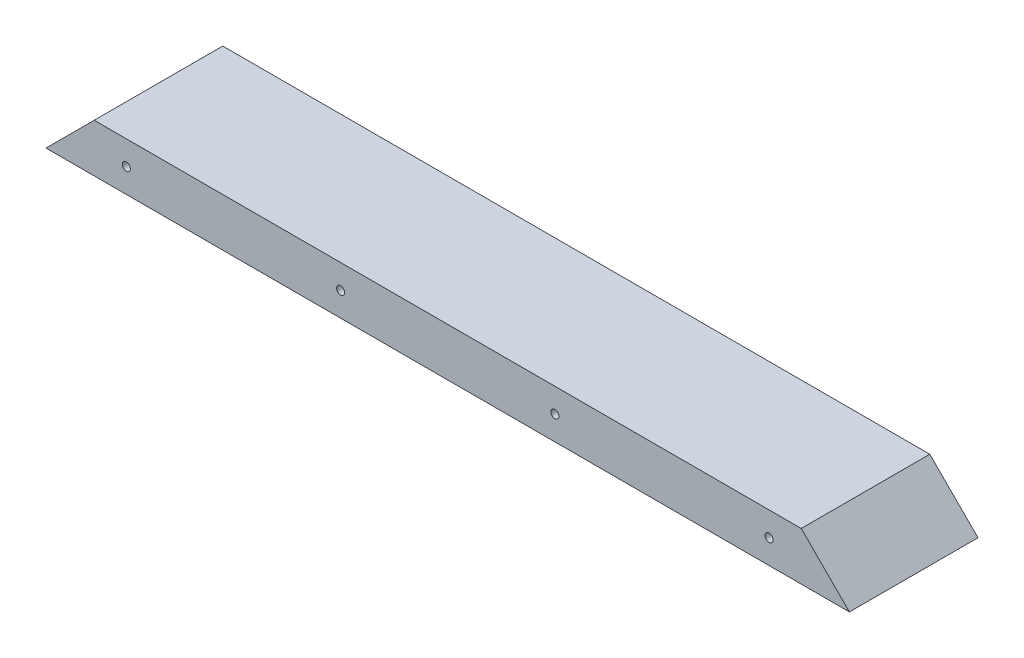
ISO-10303-21;
HEADER;
FILE_DESCRIPTION(('STEP AP214'),'2;1');
FILE_NAME('part.step','',(''),(''),'','','');
FILE_SCHEMA(('AUTOMOTIVE_DESIGN { 1 0 10303 214 1 1 1 1 }'));
ENDSEC;
DATA;
#1=APPLICATION_CONTEXT('core data for automotive mechanical design processes');
#2=APPLICATION_PROTOCOL_DEFINITION('international standard','automotive_design',2000,#1);
#3=PRODUCT_CONTEXT('',#1,'mechanical');
#4=PRODUCT('Part','Part','',(#3));
#5=PRODUCT_RELATED_PRODUCT_CATEGORY('part','',(#4));
#6=PRODUCT_DEFINITION_FORMATION('','',#4);
#7=PRODUCT_DEFINITION_CONTEXT('part definition',#1,'design');
#8=PRODUCT_DEFINITION('design','',#6,#7);
#9=PRODUCT_DEFINITION_SHAPE('','',#8);
#10=(LENGTH_UNIT() NAMED_UNIT(*) SI_UNIT(.MILLI.,.METRE.));
#11=(NAMED_UNIT(*) PLANE_ANGLE_UNIT() SI_UNIT($,.RADIAN.));
#12=(NAMED_UNIT(*) SI_UNIT($,.STERADIAN.) SOLID_ANGLE_UNIT());
#13=UNCERTAINTY_MEASURE_WITH_UNIT(LENGTH_MEASURE(1.E-05),#10,'distance_accuracy_value','');
#14=(GEOMETRIC_REPRESENTATION_CONTEXT(3) GLOBAL_UNCERTAINTY_ASSIGNED_CONTEXT((#13)) GLOBAL_UNIT_ASSIGNED_CONTEXT((#10,
#11,#12)) REPRESENTATION_CONTEXT('',''));
#15=CARTESIAN_POINT('',(0.,0.,0.));
#16=DIRECTION('',(0.,0.,1.));
#17=DIRECTION('',(1.,0.,0.));
#18=AXIS2_PLACEMENT_3D('',#15,#16,#17);
#19=CARTESIAN_POINT('',(250.,15.,20.));
#20=DIRECTION('',(0.,0.,-1.));
#21=DIRECTION('',(0.,1.,0.));
#22=AXIS2_PLACEMENT_3D('',#19,#20,#21);
#23=PLANE('',#22);
#24=CARTESIAN_POINT('',(91.6666666666667,7.50000000000017,20.));
#25=DIRECTION('',(0.,0.,-1.));
#26=DIRECTION('',(0.,1.,0.));
#27=AXIS2_PLACEMENT_3D('',#24,#25,#26);
#28=CIRCLE('',#27,1.25000000000001);
#29=CARTESIAN_POINT('',(91.6666666666667,8.75000000000018,20.));
#30=VERTEX_POINT('',#29);
#31=EDGE_CURVE('E113',#30,#30,#28,.T.);
#32=ORIENTED_EDGE('',*,*,#31,.T.);
#33=EDGE_LOOP('',(#32));
#34=FACE_BOUND('',#33,.T.);
#35=CARTESIAN_POINT('',(158.333333333333,7.49999999999995,20.));
#36=DIRECTION('',(0.,0.,-1.));
#37=DIRECTION('',(0.,1.,0.));
#38=AXIS2_PLACEMENT_3D('',#35,#36,#37);
#39=CIRCLE('',#38,1.25000000000001);
#40=CARTESIAN_POINT('',(158.333333333333,8.74999999999996,20.));
#41=VERTEX_POINT('',#40);
#42=EDGE_CURVE('E107',#41,#41,#39,.T.);
#43=ORIENTED_EDGE('',*,*,#42,.T.);
#44=EDGE_LOOP('',(#43));
#45=FACE_BOUND('',#44,.T.);
#46=CARTESIAN_POINT('',(225.,7.49999999999972,20.));
#47=DIRECTION('',(0.,0.,-1.));
#48=DIRECTION('',(0.,1.,0.));
#49=AXIS2_PLACEMENT_3D('',#46,#47,#48);
#50=CIRCLE('',#49,1.24999999999996);
#51=CARTESIAN_POINT('',(225.,8.74999999999968,20.));
#52=VERTEX_POINT('',#51);
#53=EDGE_CURVE('E101',#52,#52,#50,.T.);
#54=ORIENTED_EDGE('',*,*,#53,.T.);
#55=EDGE_LOOP('',(#54));
#56=FACE_BOUND('',#55,.T.);
#57=CARTESIAN_POINT('',(25.,7.50000000000042,20.));
#58=DIRECTION('',(0.,0.,-1.));
#59=DIRECTION('',(0.,-1.,0.));
#60=AXIS2_PLACEMENT_3D('',#57,#58,#59);
#61=CIRCLE('',#60,1.24999999999996);
#62=CARTESIAN_POINT('',(25.,6.25000000000046,20.));
#63=VERTEX_POINT('',#62);
#64=EDGE_CURVE('E95',#63,#63,#61,.T.);
#65=ORIENTED_EDGE('',*,*,#64,.T.);
#66=EDGE_LOOP('',(#65));
#67=FACE_BOUND('',#66,.T.);
#68=DIRECTION('',(-1.,0.,0.));
#69=VECTOR('',#68,1.);
#70=CARTESIAN_POINT('',(250.,0.,20.));
#71=LINE('',#70,#69);
#72=CARTESIAN_POINT('',(250.,0.,20.));
#73=VERTEX_POINT('',#72);
#74=CARTESIAN_POINT('',(0.,0.,20.));
#75=VERTEX_POINT('',#74);
#76=EDGE_CURVE('E41',#73,#75,#71,.T.);
#77=ORIENTED_EDGE('',*,*,#76,.F.);
#78=DIRECTION('',(-0.707106781186548,0.707106781186547,0.));
#79=VECTOR('',#78,1.);
#80=CARTESIAN_POINT('',(235.,15.,20.));
#81=LINE('',#80,#79);
#82=CARTESIAN_POINT('',(235.,15.,20.));
#83=VERTEX_POINT('',#82);
#84=EDGE_CURVE('E47',#73,#83,#81,.T.);
#85=ORIENTED_EDGE('',*,*,#84,.T.);
#86=DIRECTION('',(-1.,0.,0.));
#87=VECTOR('',#86,1.);
#88=CARTESIAN_POINT('',(250.,15.,20.));
#89=LINE('',#88,#87);
#90=CARTESIAN_POINT('',(15.,15.,20.));
#91=VERTEX_POINT('',#90);
#92=EDGE_CURVE('E11',#83,#91,#89,.T.);
#93=ORIENTED_EDGE('',*,*,#92,.T.);
#94=DIRECTION('',(-0.707106781186548,-0.707106781186547,0.));
#95=VECTOR('',#94,1.);
#96=CARTESIAN_POINT('',(15.,15.,20.));
#97=LINE('',#96,#95);
#98=EDGE_CURVE('E88',#91,#75,#97,.T.);
#99=ORIENTED_EDGE('',*,*,#98,.T.);
#100=EDGE_LOOP('',(#77,#85,#93,#99));
#101=FACE_BOUND('',#100,.T.);
#102=ADVANCED_FACE('F33',(#34,#45,#56,#67,#101),#23,.F.);
#103=CARTESIAN_POINT('',(250.,0.,20.));
#104=DIRECTION('',(0.,1.,0.));
#105=DIRECTION('',(0.,0.,1.));
#106=AXIS2_PLACEMENT_3D('',#103,#104,#105);
#107=PLANE('',#106);
#108=DIRECTION('',(0.,0.,-1.));
#109=VECTOR('',#108,1.);
#110=CARTESIAN_POINT('',(0.,0.,20.));
#111=LINE('',#110,#109);
#112=CARTESIAN_POINT('',(0.,0.,-20.));
#113=VERTEX_POINT('',#112);
#114=EDGE_CURVE('E75',#75,#113,#111,.T.);
#115=ORIENTED_EDGE('',*,*,#114,.T.);
#116=DIRECTION('',(-1.,0.,0.));
#117=VECTOR('',#116,1.);
#118=CARTESIAN_POINT('',(250.,0.,-20.));
#119=LINE('',#118,#117);
#120=CARTESIAN_POINT('',(250.,0.,-20.));
#121=VERTEX_POINT('',#120);
#122=EDGE_CURVE('E119',#121,#113,#119,.T.);
#123=ORIENTED_EDGE('',*,*,#122,.F.);
#124=DIRECTION('',(0.,0.,-1.));
#125=VECTOR('',#124,1.);
#126=CARTESIAN_POINT('',(250.,0.,20.));
#127=LINE('',#126,#125);
#128=EDGE_CURVE('E114',#73,#121,#127,.T.);
#129=ORIENTED_EDGE('',*,*,#128,.F.);
#130=ORIENTED_EDGE('',*,*,#76,.T.);
#131=EDGE_LOOP('',(#115,#123,#129,#130));
#132=FACE_BOUND('',#131,.T.);
#133=ADVANCED_FACE('F122',(#132),#107,.F.);
#134=CARTESIAN_POINT('',(250.,0.,-20.));
#135=DIRECTION('',(0.,0.,1.));
#136=DIRECTION('',(0.,-1.,0.));
#137=AXIS2_PLACEMENT_3D('',#134,#135,#136);
#138=PLANE('',#137);
#139=CARTESIAN_POINT('',(91.6666666666667,7.50000000000018,-20.));
#140=DIRECTION('',(0.,0.,-1.));
#141=DIRECTION('',(0.,1.,0.));
#142=AXIS2_PLACEMENT_3D('',#139,#140,#141);
#143=CIRCLE('',#142,1.25000000000001);
#144=CARTESIAN_POINT('',(91.6666666666667,8.75000000000019,-20.));
#145=VERTEX_POINT('',#144);
#146=EDGE_CURVE('E239',#145,#145,#143,.T.);
#147=ORIENTED_EDGE('',*,*,#146,.F.);
#148=EDGE_LOOP('',(#147));
#149=FACE_BOUND('',#148,.T.);
#150=CARTESIAN_POINT('',(158.333333333333,7.49999999999996,-20.));
#151=DIRECTION('',(0.,0.,-1.));
#152=DIRECTION('',(0.,1.,0.));
#153=AXIS2_PLACEMENT_3D('',#150,#151,#152);
#154=CIRCLE('',#153,1.25000000000001);
#155=CARTESIAN_POINT('',(158.333333333333,8.74999999999997,-20.));
#156=VERTEX_POINT('',#155);
#157=EDGE_CURVE('E110',#156,#156,#154,.T.);
#158=ORIENTED_EDGE('',*,*,#157,.F.);
#159=EDGE_LOOP('',(#158));
#160=FACE_BOUND('',#159,.T.);
#161=CARTESIAN_POINT('',(225.,7.49999999999973,-20.));
#162=DIRECTION('',(0.,0.,-1.));
#163=DIRECTION('',(0.,1.,0.));
#164=AXIS2_PLACEMENT_3D('',#161,#162,#163);
#165=CIRCLE('',#164,1.24999999999996);
#166=CARTESIAN_POINT('',(225.,8.74999999999969,-20.));
#167=VERTEX_POINT('',#166);
#168=EDGE_CURVE('E104',#167,#167,#165,.T.);
#169=ORIENTED_EDGE('',*,*,#168,.F.);
#170=EDGE_LOOP('',(#169));
#171=FACE_BOUND('',#170,.T.);
#172=CARTESIAN_POINT('',(25.,7.50000000000043,-20.));
#173=DIRECTION('',(0.,0.,-1.));
#174=DIRECTION('',(0.,-1.,0.));
#175=AXIS2_PLACEMENT_3D('',#172,#173,#174);
#176=CIRCLE('',#175,1.24999999999996);
#177=CARTESIAN_POINT('',(25.,6.25000000000047,-20.));
#178=VERTEX_POINT('',#177);
#179=EDGE_CURVE('E98',#178,#178,#176,.T.);
#180=ORIENTED_EDGE('',*,*,#179,.F.);
#181=EDGE_LOOP('',(#180));
#182=FACE_BOUND('',#181,.T.);
#183=DIRECTION('',(-1.,0.,0.));
#184=VECTOR('',#183,1.);
#185=CARTESIAN_POINT('',(250.,15.,-20.));
#186=LINE('',#185,#184);
#187=CARTESIAN_POINT('',(235.,15.,-20.));
#188=VERTEX_POINT('',#187);
#189=CARTESIAN_POINT('',(15.,15.,-20.));
#190=VERTEX_POINT('',#189);
#191=EDGE_CURVE('E85',#188,#190,#186,.T.);
#192=ORIENTED_EDGE('',*,*,#191,.F.);
#193=DIRECTION('',(-0.707106781186548,0.707106781186547,0.));
#194=VECTOR('',#193,1.);
#195=CARTESIAN_POINT('',(235.,15.,-20.));
#196=LINE('',#195,#194);
#197=EDGE_CURVE('E70',#121,#188,#196,.T.);
#198=ORIENTED_EDGE('',*,*,#197,.F.);
#199=ORIENTED_EDGE('',*,*,#122,.T.);
#200=DIRECTION('',(-0.707106781186548,-0.707106781186547,0.));
#201=VECTOR('',#200,1.);
#202=CARTESIAN_POINT('',(15.,15.,-20.));
#203=LINE('',#202,#201);
#204=EDGE_CURVE('E91',#190,#113,#203,.T.);
#205=ORIENTED_EDGE('',*,*,#204,.F.);
#206=EDGE_LOOP('',(#192,#198,#199,#205));
#207=FACE_BOUND('',#206,.T.);
#208=ADVANCED_FACE('F125',(#149,#160,#171,#182,#207),#138,.F.);
#209=CARTESIAN_POINT('',(250.,15.,-20.));
#210=DIRECTION('',(0.,-1.,0.));
#211=DIRECTION('',(0.,0.,-1.));
#212=AXIS2_PLACEMENT_3D('',#209,#210,#211);
#213=PLANE('',#212);
#214=ORIENTED_EDGE('',*,*,#92,.F.);
#215=DIRECTION('',(0.,0.,-1.));
#216=VECTOR('',#215,1.);
#217=CARTESIAN_POINT('',(235.,15.,20.));
#218=LINE('',#217,#216);
#219=EDGE_CURVE('E67',#83,#188,#218,.T.);
#220=ORIENTED_EDGE('',*,*,#219,.T.);
#221=ORIENTED_EDGE('',*,*,#191,.T.);
#222=DIRECTION('',(0.,0.,-1.));
#223=VECTOR('',#222,1.);
#224=CARTESIAN_POINT('',(15.,15.,20.));
#225=LINE('',#224,#223);
#226=EDGE_CURVE('E84',#91,#190,#225,.T.);
#227=ORIENTED_EDGE('',*,*,#226,.F.);
#228=EDGE_LOOP('',(#214,#220,#221,#227));
#229=FACE_BOUND('',#228,.T.);
#230=ADVANCED_FACE('F83',(#229),#213,.F.);
#231=CARTESIAN_POINT('',(15.,15.,20.));
#232=DIRECTION('',(0.707106781186547,-0.707106781186548,0.));
#233=DIRECTION('',(0.707106781186548,0.707106781186547,0.));
#234=AXIS2_PLACEMENT_3D('',#231,#232,#233);
#235=PLANE('',#234);
#236=ORIENTED_EDGE('',*,*,#204,.T.);
#237=ORIENTED_EDGE('',*,*,#114,.F.);
#238=ORIENTED_EDGE('',*,*,#98,.F.);
#239=ORIENTED_EDGE('',*,*,#226,.T.);
#240=EDGE_LOOP('',(#236,#237,#238,#239));
#241=FACE_BOUND('',#240,.T.);
#242=ADVANCED_FACE('F126',(#241),#235,.F.);
#243=CARTESIAN_POINT('',(235.,15.,20.));
#244=DIRECTION('',(-0.707106781186547,-0.707106781186548,0.));
#245=DIRECTION('',(0.707106781186548,-0.707106781186547,0.));
#246=AXIS2_PLACEMENT_3D('',#243,#244,#245);
#247=PLANE('',#246);
#248=ORIENTED_EDGE('',*,*,#197,.T.);
#249=ORIENTED_EDGE('',*,*,#219,.F.);
#250=ORIENTED_EDGE('',*,*,#84,.F.);
#251=ORIENTED_EDGE('',*,*,#128,.T.);
#252=EDGE_LOOP('',(#248,#249,#250,#251));
#253=FACE_BOUND('',#252,.T.);
#254=ADVANCED_FACE('F68',(#253),#247,.F.);
#255=CARTESIAN_POINT('',(25.,7.50000000000042,20.));
#256=DIRECTION('',(0.,0.,-1.));
#257=DIRECTION('',(0.,1.,0.));
#258=AXIS2_PLACEMENT_3D('',#255,#256,#257);
#259=CYLINDRICAL_SURFACE('',#258,1.24999999999996);
#260=ORIENTED_EDGE('',*,*,#64,.F.);
#261=EDGE_LOOP('',(#260));
#262=FACE_BOUND('',#261,.T.);
#263=ORIENTED_EDGE('',*,*,#179,.T.);
#264=EDGE_LOOP('',(#263));
#265=FACE_BOUND('',#264,.T.);
#266=ADVANCED_FACE('F133',(#262,#265),#259,.F.);
#267=CARTESIAN_POINT('',(225.,7.49999999999972,20.));
#268=DIRECTION('',(0.,0.,-1.));
#269=DIRECTION('',(0.,1.,0.));
#270=AXIS2_PLACEMENT_3D('',#267,#268,#269);
#271=CYLINDRICAL_SURFACE('',#270,1.24999999999996);
#272=ORIENTED_EDGE('',*,*,#53,.F.);
#273=EDGE_LOOP('',(#272));
#274=FACE_BOUND('',#273,.T.);
#275=ORIENTED_EDGE('',*,*,#168,.T.);
#276=EDGE_LOOP('',(#275));
#277=FACE_BOUND('',#276,.T.);
#278=ADVANCED_FACE('F154',(#274,#277),#271,.F.);
#279=CARTESIAN_POINT('',(158.333333333333,7.49999999999995,20.));
#280=DIRECTION('',(0.,0.,-1.));
#281=DIRECTION('',(0.,1.,0.));
#282=AXIS2_PLACEMENT_3D('',#279,#280,#281);
#283=CYLINDRICAL_SURFACE('',#282,1.25000000000001);
#284=ORIENTED_EDGE('',*,*,#42,.F.);
#285=EDGE_LOOP('',(#284));
#286=FACE_BOUND('',#285,.T.);
#287=ORIENTED_EDGE('',*,*,#157,.T.);
#288=EDGE_LOOP('',(#287));
#289=FACE_BOUND('',#288,.T.);
#290=ADVANCED_FACE('F165',(#286,#289),#283,.F.);
#291=CARTESIAN_POINT('',(91.6666666666667,7.50000000000017,20.));
#292=DIRECTION('',(0.,0.,-1.));
#293=DIRECTION('',(0.,1.,0.));
#294=AXIS2_PLACEMENT_3D('',#291,#292,#293);
#295=CYLINDRICAL_SURFACE('',#294,1.25000000000001);
#296=ORIENTED_EDGE('',*,*,#31,.F.);
#297=EDGE_LOOP('',(#296));
#298=FACE_BOUND('',#297,.T.);
#299=ORIENTED_EDGE('',*,*,#146,.T.);
#300=EDGE_LOOP('',(#299));
#301=FACE_BOUND('',#300,.T.);
#302=ADVANCED_FACE('F168',(#298,#301),#295,.F.);
#303=CLOSED_SHELL('',(#102,#133,#208,#230,#242,#254,#266,#278,#290,#302));
#304=MANIFOLD_SOLID_BREP('B2',#303);
#305=ADVANCED_BREP_SHAPE_REPRESENTATION('',(#18,#304),#14);
#306=SHAPE_DEFINITION_REPRESENTATION(#9,#305);
ENDSEC;
END-ISO-10303-21;
